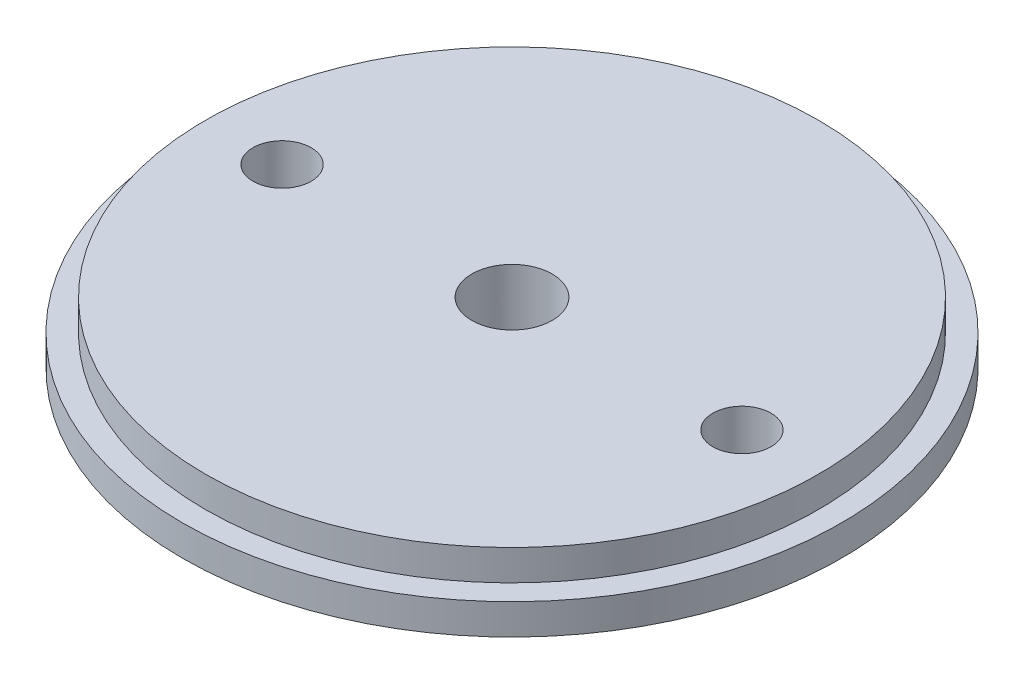
ISO-10303-21;
HEADER;
FILE_DESCRIPTION(('STEP AP214'),'2;1');
FILE_NAME('part.step','',(''),(''),'','','');
FILE_SCHEMA(('AUTOMOTIVE_DESIGN { 1 0 10303 214 1 1 1 1 }'));
ENDSEC;
DATA;
#1=APPLICATION_CONTEXT('core data for automotive mechanical design processes');
#2=APPLICATION_PROTOCOL_DEFINITION('international standard','automotive_design',2000,#1);
#3=PRODUCT_CONTEXT('',#1,'mechanical');
#4=PRODUCT('Part','Part','',(#3));
#5=PRODUCT_RELATED_PRODUCT_CATEGORY('part','',(#4));
#6=PRODUCT_DEFINITION_FORMATION('','',#4);
#7=PRODUCT_DEFINITION_CONTEXT('part definition',#1,'design');
#8=PRODUCT_DEFINITION('design','',#6,#7);
#9=PRODUCT_DEFINITION_SHAPE('','',#8);
#10=(LENGTH_UNIT() NAMED_UNIT(*) SI_UNIT(.MILLI.,.METRE.));
#11=(NAMED_UNIT(*) PLANE_ANGLE_UNIT() SI_UNIT($,.RADIAN.));
#12=(NAMED_UNIT(*) SI_UNIT($,.STERADIAN.) SOLID_ANGLE_UNIT());
#13=UNCERTAINTY_MEASURE_WITH_UNIT(LENGTH_MEASURE(1.E-05),#10,'distance_accuracy_value','');
#14=(GEOMETRIC_REPRESENTATION_CONTEXT(3) GLOBAL_UNCERTAINTY_ASSIGNED_CONTEXT((#13)) GLOBAL_UNIT_ASSIGNED_CONTEXT((#10,
#11,#12)) REPRESENTATION_CONTEXT('',''));
#15=CARTESIAN_POINT('',(0.,0.,0.));
#16=DIRECTION('',(0.,0.,1.));
#17=DIRECTION('',(1.,0.,0.));
#18=AXIS2_PLACEMENT_3D('',#15,#16,#17);
#19=CARTESIAN_POINT('',(0.,2.54,0.));
#20=DIRECTION('',(0.,-1.,0.));
#21=DIRECTION('',(0.,0.,-1.));
#22=AXIS2_PLACEMENT_3D('',#19,#20,#21);
#23=CYLINDRICAL_SURFACE('',#22,27.305);
#24=CARTESIAN_POINT('',(0.,2.54,0.));
#25=DIRECTION('',(0.,1.,0.));
#26=DIRECTION('',(0.,0.,1.));
#27=AXIS2_PLACEMENT_3D('',#24,#25,#26);
#28=CIRCLE('',#27,27.305);
#29=CARTESIAN_POINT('',(0.,2.54,27.305));
#30=VERTEX_POINT('',#29);
#31=EDGE_CURVE('E45',#30,#30,#28,.T.);
#32=ORIENTED_EDGE('',*,*,#31,.F.);
#33=EDGE_LOOP('',(#32));
#34=FACE_BOUND('',#33,.T.);
#35=CARTESIAN_POINT('',(0.,0.,0.));
#36=DIRECTION('',(0.,1.,0.));
#37=DIRECTION('',(0.,0.,1.));
#38=AXIS2_PLACEMENT_3D('',#35,#36,#37);
#39=CIRCLE('',#38,27.305);
#40=CARTESIAN_POINT('',(0.,0.,27.305));
#41=VERTEX_POINT('',#40);
#42=EDGE_CURVE('E41',#41,#41,#39,.T.);
#43=ORIENTED_EDGE('',*,*,#42,.T.);
#44=EDGE_LOOP('',(#43));
#45=FACE_BOUND('',#44,.T.);
#46=ADVANCED_FACE('F38',(#34,#45),#23,.T.);
#47=CARTESIAN_POINT('',(0.,2.54,0.));
#48=DIRECTION('',(0.,1.,0.));
#49=DIRECTION('',(0.,0.,1.));
#50=AXIS2_PLACEMENT_3D('',#47,#48,#49);
#51=PLANE('',#50);
#52=CARTESIAN_POINT('',(0.,2.54,0.));
#53=DIRECTION('',(0.,1.,0.));
#54=DIRECTION('',(0.,0.,1.));
#55=AXIS2_PLACEMENT_3D('',#52,#53,#54);
#56=CIRCLE('',#55,25.4);
#57=CARTESIAN_POINT('',(0.,2.54,25.4));
#58=VERTEX_POINT('',#57);
#59=EDGE_CURVE('E10',#58,#58,#56,.T.);
#60=ORIENTED_EDGE('',*,*,#59,.F.);
#61=EDGE_LOOP('',(#60));
#62=FACE_BOUND('',#61,.T.);
#63=ORIENTED_EDGE('',*,*,#31,.T.);
#64=EDGE_LOOP('',(#63));
#65=FACE_BOUND('',#64,.T.);
#66=ADVANCED_FACE('F79',(#62,#65),#51,.T.);
#67=CARTESIAN_POINT('',(0.,0.,0.));
#68=DIRECTION('',(0.,1.,0.));
#69=DIRECTION('',(0.,0.,1.));
#70=AXIS2_PLACEMENT_3D('',#67,#68,#69);
#71=PLANE('',#70);
#72=CARTESIAN_POINT('',(19.05,0.,0.));
#73=DIRECTION('',(0.,-1.,0.));
#74=DIRECTION('',(0.,0.,-1.));
#75=AXIS2_PLACEMENT_3D('',#72,#73,#74);
#76=CIRCLE('',#75,2.413);
#77=CARTESIAN_POINT('',(19.05,0.,-2.413));
#78=VERTEX_POINT('',#77);
#79=EDGE_CURVE('E64',#78,#78,#76,.T.);
#80=ORIENTED_EDGE('',*,*,#79,.F.);
#81=EDGE_LOOP('',(#80));
#82=FACE_BOUND('',#81,.T.);
#83=CARTESIAN_POINT('',(-19.05,0.,0.));
#84=DIRECTION('',(0.,-1.,0.));
#85=DIRECTION('',(0.,0.,-1.));
#86=AXIS2_PLACEMENT_3D('',#83,#84,#85);
#87=CIRCLE('',#86,2.413);
#88=CARTESIAN_POINT('',(-19.05,0.,-2.413));
#89=VERTEX_POINT('',#88);
#90=EDGE_CURVE('E58',#89,#89,#87,.T.);
#91=ORIENTED_EDGE('',*,*,#90,.F.);
#92=EDGE_LOOP('',(#91));
#93=FACE_BOUND('',#92,.T.);
#94=CARTESIAN_POINT('',(0.,0.,0.));
#95=DIRECTION('',(0.,-1.,0.));
#96=DIRECTION('',(0.,0.,-1.));
#97=AXIS2_PLACEMENT_3D('',#94,#95,#96);
#98=CIRCLE('',#97,3.33461692411148);
#99=CARTESIAN_POINT('',(0.,0.,-3.33461692411148));
#100=VERTEX_POINT('',#99);
#101=EDGE_CURVE('E54',#100,#100,#98,.T.);
#102=ORIENTED_EDGE('',*,*,#101,.F.);
#103=EDGE_LOOP('',(#102));
#104=FACE_BOUND('',#103,.T.);
#105=ORIENTED_EDGE('',*,*,#42,.F.);
#106=EDGE_LOOP('',(#105));
#107=FACE_BOUND('',#106,.T.);
#108=ADVANCED_FACE('F75',(#82,#93,#104,#107),#71,.F.);
#109=CARTESIAN_POINT('',(0.,5.08,0.));
#110=DIRECTION('',(0.,-1.,0.));
#111=DIRECTION('',(0.,0.,-1.));
#112=AXIS2_PLACEMENT_3D('',#109,#110,#111);
#113=CYLINDRICAL_SURFACE('',#112,25.4);
#114=CARTESIAN_POINT('',(0.,5.08,0.));
#115=DIRECTION('',(0.,1.,0.));
#116=DIRECTION('',(0.,0.,1.));
#117=AXIS2_PLACEMENT_3D('',#114,#115,#116);
#118=CIRCLE('',#117,25.4);
#119=CARTESIAN_POINT('',(0.,5.08,25.4));
#120=VERTEX_POINT('',#119);
#121=EDGE_CURVE('E51',#120,#120,#118,.T.);
#122=ORIENTED_EDGE('',*,*,#121,.F.);
#123=EDGE_LOOP('',(#122));
#124=FACE_BOUND('',#123,.T.);
#125=ORIENTED_EDGE('',*,*,#59,.T.);
#126=EDGE_LOOP('',(#125));
#127=FACE_BOUND('',#126,.T.);
#128=ADVANCED_FACE('F78',(#124,#127),#113,.T.);
#129=CARTESIAN_POINT('',(0.,5.08,0.));
#130=DIRECTION('',(0.,1.,0.));
#131=DIRECTION('',(0.,0.,1.));
#132=AXIS2_PLACEMENT_3D('',#129,#130,#131);
#133=PLANE('',#132);
#134=CARTESIAN_POINT('',(19.05,5.08,0.));
#135=DIRECTION('',(0.,1.,0.));
#136=DIRECTION('',(0.,0.,1.));
#137=AXIS2_PLACEMENT_3D('',#134,#135,#136);
#138=CIRCLE('',#137,2.413);
#139=CARTESIAN_POINT('',(19.05,5.08,2.413));
#140=VERTEX_POINT('',#139);
#141=EDGE_CURVE('E61',#140,#140,#138,.F.);
#142=ORIENTED_EDGE('',*,*,#141,.T.);
#143=EDGE_LOOP('',(#142));
#144=FACE_BOUND('',#143,.T.);
#145=CARTESIAN_POINT('',(-19.05,5.08,0.));
#146=DIRECTION('',(0.,1.,0.));
#147=DIRECTION('',(0.,0.,1.));
#148=AXIS2_PLACEMENT_3D('',#145,#146,#147);
#149=CIRCLE('',#148,2.413);
#150=CARTESIAN_POINT('',(-19.05,5.08,2.413));
#151=VERTEX_POINT('',#150);
#152=EDGE_CURVE('E67',#151,#151,#149,.F.);
#153=ORIENTED_EDGE('',*,*,#152,.T.);
#154=EDGE_LOOP('',(#153));
#155=FACE_BOUND('',#154,.T.);
#156=CARTESIAN_POINT('',(0.,5.08,0.));
#157=DIRECTION('',(0.,1.,0.));
#158=DIRECTION('',(0.,0.,1.));
#159=AXIS2_PLACEMENT_3D('',#156,#157,#158);
#160=CIRCLE('',#159,3.33461692411148);
#161=CARTESIAN_POINT('',(0.,5.08,3.33461692411148));
#162=VERTEX_POINT('',#161);
#163=EDGE_CURVE('E55',#162,#162,#160,.F.);
#164=ORIENTED_EDGE('',*,*,#163,.T.);
#165=EDGE_LOOP('',(#164));
#166=FACE_BOUND('',#165,.T.);
#167=ORIENTED_EDGE('',*,*,#121,.T.);
#168=EDGE_LOOP('',(#167));
#169=FACE_BOUND('',#168,.T.);
#170=ADVANCED_FACE('F100',(#144,#155,#166,#169),#133,.T.);
#171=CARTESIAN_POINT('',(0.,5.081,0.));
#172=DIRECTION('',(0.,-1.,0.));
#173=DIRECTION('',(0.,0.,-1.));
#174=AXIS2_PLACEMENT_3D('',#171,#172,#173);
#175=CYLINDRICAL_SURFACE('',#174,3.33461692411148);
#176=ORIENTED_EDGE('',*,*,#163,.F.);
#177=EDGE_LOOP('',(#176));
#178=FACE_BOUND('',#177,.T.);
#179=ORIENTED_EDGE('',*,*,#101,.T.);
#180=EDGE_LOOP('',(#179));
#181=FACE_BOUND('',#180,.T.);
#182=ADVANCED_FACE('F104',(#178,#181),#175,.F.);
#183=CARTESIAN_POINT('',(-19.05,5.081,0.));
#184=DIRECTION('',(0.,-1.,0.));
#185=DIRECTION('',(0.,0.,-1.));
#186=AXIS2_PLACEMENT_3D('',#183,#184,#185);
#187=CYLINDRICAL_SURFACE('',#186,2.413);
#188=ORIENTED_EDGE('',*,*,#152,.F.);
#189=EDGE_LOOP('',(#188));
#190=FACE_BOUND('',#189,.T.);
#191=ORIENTED_EDGE('',*,*,#90,.T.);
#192=EDGE_LOOP('',(#191));
#193=FACE_BOUND('',#192,.T.);
#194=ADVANCED_FACE('F73',(#190,#193),#187,.F.);
#195=CARTESIAN_POINT('',(19.05,5.081,0.));
#196=DIRECTION('',(0.,-1.,0.));
#197=DIRECTION('',(0.,0.,-1.));
#198=AXIS2_PLACEMENT_3D('',#195,#196,#197);
#199=CYLINDRICAL_SURFACE('',#198,2.413);
#200=ORIENTED_EDGE('',*,*,#141,.F.);
#201=EDGE_LOOP('',(#200));
#202=FACE_BOUND('',#201,.T.);
#203=ORIENTED_EDGE('',*,*,#79,.T.);
#204=EDGE_LOOP('',(#203));
#205=FACE_BOUND('',#204,.T.);
#206=ADVANCED_FACE('F109',(#202,#205),#199,.F.);
#207=CLOSED_SHELL('',(#46,#66,#108,#128,#170,#182,#194,#206));
#208=MANIFOLD_SOLID_BREP('B2',#207);
#209=ADVANCED_BREP_SHAPE_REPRESENTATION('',(#18,#208),#14);
#210=SHAPE_DEFINITION_REPRESENTATION(#9,#209);
ENDSEC;
END-ISO-10303-21;
